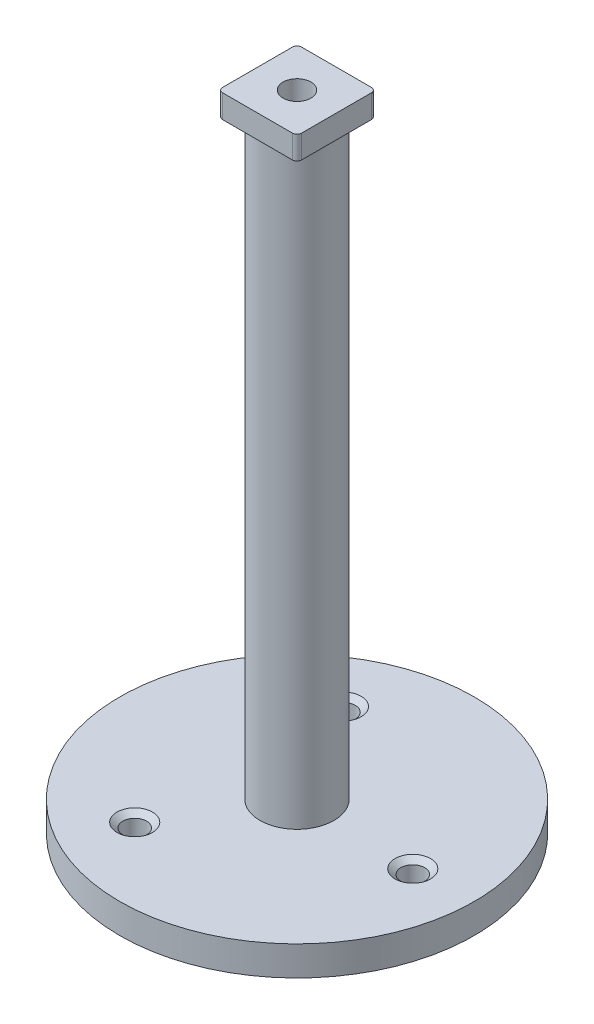
ISO-10303-21;
HEADER;
FILE_DESCRIPTION(('STEP AP214'),'2;1');
FILE_NAME('part.step','',(''),(''),'','','');
FILE_SCHEMA(('AUTOMOTIVE_DESIGN { 1 0 10303 214 1 1 1 1 }'));
ENDSEC;
DATA;
#1=APPLICATION_CONTEXT('core data for automotive mechanical design processes');
#2=APPLICATION_PROTOCOL_DEFINITION('international standard','automotive_design',2000,#1);
#3=PRODUCT_CONTEXT('',#1,'mechanical');
#4=PRODUCT('Part','Part','',(#3));
#5=PRODUCT_RELATED_PRODUCT_CATEGORY('part','',(#4));
#6=PRODUCT_DEFINITION_FORMATION('','',#4);
#7=PRODUCT_DEFINITION_CONTEXT('part definition',#1,'design');
#8=PRODUCT_DEFINITION('design','',#6,#7);
#9=PRODUCT_DEFINITION_SHAPE('','',#8);
#10=(LENGTH_UNIT() NAMED_UNIT(*) SI_UNIT(.MILLI.,.METRE.));
#11=(NAMED_UNIT(*) PLANE_ANGLE_UNIT() SI_UNIT($,.RADIAN.));
#12=(NAMED_UNIT(*) SI_UNIT($,.STERADIAN.) SOLID_ANGLE_UNIT());
#13=UNCERTAINTY_MEASURE_WITH_UNIT(LENGTH_MEASURE(1.E-05),#10,'distance_accuracy_value','');
#14=(GEOMETRIC_REPRESENTATION_CONTEXT(3) GLOBAL_UNCERTAINTY_ASSIGNED_CONTEXT((#13)) GLOBAL_UNIT_ASSIGNED_CONTEXT((#10,
#11,#12)) REPRESENTATION_CONTEXT('',''));
#15=CARTESIAN_POINT('',(0.,0.,0.));
#16=DIRECTION('',(0.,0.,1.));
#17=DIRECTION('',(1.,0.,0.));
#18=AXIS2_PLACEMENT_3D('',#15,#16,#17);
#19=CARTESIAN_POINT('',(0.,131.176985840386,0.));
#20=DIRECTION('',(0.,1.,0.));
#21=DIRECTION('',(0.,0.,1.));
#22=AXIS2_PLACEMENT_3D('',#19,#20,#21);
#23=CYLINDRICAL_SURFACE('',#22,7.93750000000001);
#24=CARTESIAN_POINT('',(0.,133.1,0.));
#25=DIRECTION('',(0.,1.,0.));
#26=DIRECTION('',(0.,0.,1.));
#27=AXIS2_PLACEMENT_3D('',#24,#25,#26);
#28=CIRCLE('',#27,7.93750000000001);
#29=CARTESIAN_POINT('',(0.,133.1,7.93750000000001));
#30=VERTEX_POINT('',#29);
#31=EDGE_CURVE('E12',#30,#30,#28,.F.);
#32=ORIENTED_EDGE('',*,*,#31,.T.);
#33=EDGE_LOOP('',(#32));
#34=FACE_BOUND('',#33,.T.);
#35=CARTESIAN_POINT('',(0.,6.34999999999999,0.));
#36=DIRECTION('',(0.,1.,0.));
#37=DIRECTION('',(0.,0.,1.));
#38=AXIS2_PLACEMENT_3D('',#35,#36,#37);
#39=CIRCLE('',#38,7.93750000000001);
#40=CARTESIAN_POINT('',(0.,6.34999999999999,7.93750000000001));
#41=VERTEX_POINT('',#40);
#42=EDGE_CURVE('E178',#41,#41,#39,.T.);
#43=ORIENTED_EDGE('',*,*,#42,.T.);
#44=EDGE_LOOP('',(#43));
#45=FACE_BOUND('',#44,.T.);
#46=ADVANCED_FACE('F44',(#34,#45),#23,.T.);
#47=CARTESIAN_POINT('',(38.1,6.35,0.));
#48=DIRECTION('',(0.,-1.,0.));
#49=DIRECTION('',(0.,0.,-1.));
#50=AXIS2_PLACEMENT_3D('',#47,#48,#49);
#51=PLANE('',#50);
#52=CARTESIAN_POINT('',(-12.2551624951336,6.35,-22.2479435503121));
#53=DIRECTION('',(0.,1.,0.));
#54=DIRECTION('',(0.,0.,1.));
#55=AXIS2_PLACEMENT_3D('',#52,#53,#54);
#56=CIRCLE('',#55,3.81);
#57=CARTESIAN_POINT('',(-12.2551624951336,6.35,-18.4379435503121));
#58=VERTEX_POINT('',#57);
#59=EDGE_CURVE('E313',#58,#58,#56,.T.);
#60=ORIENTED_EDGE('',*,*,#59,.F.);
#61=EDGE_LOOP('',(#60));
#62=FACE_BOUND('',#61,.T.);
#63=CARTESIAN_POINT('',(25.3948655440997,6.35,0.510689726862291));
#64=DIRECTION('',(0.,1.,0.));
#65=DIRECTION('',(0.,0.,1.));
#66=AXIS2_PLACEMENT_3D('',#63,#64,#65);
#67=CIRCLE('',#66,3.81);
#68=CARTESIAN_POINT('',(25.3948655440997,6.35,4.32068972686229));
#69=VERTEX_POINT('',#68);
#70=EDGE_CURVE('E301',#69,#69,#67,.T.);
#71=ORIENTED_EDGE('',*,*,#70,.F.);
#72=EDGE_LOOP('',(#71));
#73=FACE_BOUND('',#72,.T.);
#74=CARTESIAN_POINT('',(-13.1397030489638,6.35,21.7372538234475));
#75=DIRECTION('',(0.,1.,0.));
#76=DIRECTION('',(0.,0.,1.));
#77=AXIS2_PLACEMENT_3D('',#74,#75,#76);
#78=CIRCLE('',#77,3.81);
#79=CARTESIAN_POINT('',(-13.1397030489638,6.35,25.5472538234475));
#80=VERTEX_POINT('',#79);
#81=EDGE_CURVE('E289',#80,#80,#78,.T.);
#82=ORIENTED_EDGE('',*,*,#81,.F.);
#83=EDGE_LOOP('',(#82));
#84=FACE_BOUND('',#83,.T.);
#85=ORIENTED_EDGE('',*,*,#42,.F.);
#86=EDGE_LOOP('',(#85));
#87=FACE_BOUND('',#86,.T.);
#88=CARTESIAN_POINT('',(0.,6.34999999999999,0.));
#89=DIRECTION('',(0.,1.,0.));
#90=DIRECTION('',(0.,0.,1.));
#91=AXIS2_PLACEMENT_3D('',#88,#89,#90);
#92=CIRCLE('',#91,38.1);
#93=CARTESIAN_POINT('',(0.,6.34999999999999,38.1));
#94=VERTEX_POINT('',#93);
#95=EDGE_CURVE('E174',#94,#94,#92,.T.);
#96=ORIENTED_EDGE('',*,*,#95,.T.);
#97=EDGE_LOOP('',(#96));
#98=FACE_BOUND('',#97,.T.);
#99=ADVANCED_FACE('F238',(#62,#73,#84,#87,#98),#51,.F.);
#100=CARTESIAN_POINT('',(0.,131.176985840386,0.));
#101=DIRECTION('',(0.,1.,0.));
#102=DIRECTION('',(0.,0.,1.));
#103=AXIS2_PLACEMENT_3D('',#100,#101,#102);
#104=CYLINDRICAL_SURFACE('',#103,38.1);
#105=ORIENTED_EDGE('',*,*,#95,.F.);
#106=EDGE_LOOP('',(#105));
#107=FACE_BOUND('',#106,.T.);
#108=CARTESIAN_POINT('',(0.,0.,0.));
#109=DIRECTION('',(0.,1.,0.));
#110=DIRECTION('',(0.,0.,1.));
#111=AXIS2_PLACEMENT_3D('',#108,#109,#110);
#112=CIRCLE('',#111,38.1);
#113=CARTESIAN_POINT('',(0.,0.,38.1));
#114=VERTEX_POINT('',#113);
#115=EDGE_CURVE('E170',#114,#114,#112,.T.);
#116=ORIENTED_EDGE('',*,*,#115,.T.);
#117=EDGE_LOOP('',(#116));
#118=FACE_BOUND('',#117,.T.);
#119=ADVANCED_FACE('F245',(#107,#118),#104,.T.);
#120=CARTESIAN_POINT('',(0.,0.,0.));
#121=DIRECTION('',(0.,1.,0.));
#122=DIRECTION('',(0.,0.,1.));
#123=AXIS2_PLACEMENT_3D('',#120,#121,#122);
#124=PLANE('',#123);
#125=CARTESIAN_POINT('',(-12.2551624951336,0.,-22.2479435503121));
#126=DIRECTION('',(0.,1.,0.));
#127=DIRECTION('',(0.,0.,1.));
#128=AXIS2_PLACEMENT_3D('',#125,#126,#127);
#129=CIRCLE('',#128,2.5527);
#130=CARTESIAN_POINT('',(-12.2551624951336,0.,-19.6952435503121));
#131=VERTEX_POINT('',#130);
#132=EDGE_CURVE('E305',#131,#131,#129,.T.);
#133=ORIENTED_EDGE('',*,*,#132,.T.);
#134=EDGE_LOOP('',(#133));
#135=FACE_BOUND('',#134,.T.);
#136=CARTESIAN_POINT('',(25.3948655440997,0.,0.510689726862291));
#137=DIRECTION('',(0.,1.,0.));
#138=DIRECTION('',(0.,0.,1.));
#139=AXIS2_PLACEMENT_3D('',#136,#137,#138);
#140=CIRCLE('',#139,2.5527);
#141=CARTESIAN_POINT('',(25.3948655440997,0.,3.06338972686229));
#142=VERTEX_POINT('',#141);
#143=EDGE_CURVE('E293',#142,#142,#140,.T.);
#144=ORIENTED_EDGE('',*,*,#143,.T.);
#145=EDGE_LOOP('',(#144));
#146=FACE_BOUND('',#145,.T.);
#147=CARTESIAN_POINT('',(-13.1397030489638,0.,21.7372538234475));
#148=DIRECTION('',(0.,1.,0.));
#149=DIRECTION('',(0.,0.,1.));
#150=AXIS2_PLACEMENT_3D('',#147,#148,#149);
#151=CIRCLE('',#150,2.5527);
#152=CARTESIAN_POINT('',(-13.1397030489638,0.,24.2899538234475));
#153=VERTEX_POINT('',#152);
#154=EDGE_CURVE('E281',#153,#153,#151,.T.);
#155=ORIENTED_EDGE('',*,*,#154,.T.);
#156=EDGE_LOOP('',(#155));
#157=FACE_BOUND('',#156,.T.);
#158=CARTESIAN_POINT('',(0.,0.,0.));
#159=DIRECTION('',(0.,1.,0.));
#160=DIRECTION('',(0.,0.,1.));
#161=AXIS2_PLACEMENT_3D('',#158,#159,#160);
#162=CIRCLE('',#161,7.14375);
#163=CARTESIAN_POINT('',(0.,0.,7.14375));
#164=VERTEX_POINT('',#163);
#165=EDGE_CURVE('E162',#164,#164,#162,.T.);
#166=ORIENTED_EDGE('',*,*,#165,.T.);
#167=EDGE_LOOP('',(#166));
#168=FACE_BOUND('',#167,.T.);
#169=ORIENTED_EDGE('',*,*,#115,.F.);
#170=EDGE_LOOP('',(#169));
#171=FACE_BOUND('',#170,.T.);
#172=ADVANCED_FACE('F330',(#135,#146,#157,#168,#171),#124,.F.);
#173=CARTESIAN_POINT('',(0.,153.555576272406,0.));
#174=DIRECTION('',(0.,-1.,0.));
#175=DIRECTION('',(0.,0.,-1.));
#176=AXIS2_PLACEMENT_3D('',#173,#174,#175);
#177=CYLINDRICAL_SURFACE('',#176,7.14375);
#178=CARTESIAN_POINT('',(0.,120.65,0.));
#179=DIRECTION('',(0.,-1.,0.));
#180=DIRECTION('',(0.,0.,-1.));
#181=AXIS2_PLACEMENT_3D('',#178,#179,#180);
#182=CIRCLE('',#181,7.14375);
#183=CARTESIAN_POINT('',(0.,120.65,-7.14375));
#184=VERTEX_POINT('',#183);
#185=EDGE_CURVE('E166',#184,#184,#182,.T.);
#186=ORIENTED_EDGE('',*,*,#185,.F.);
#187=EDGE_LOOP('',(#186));
#188=FACE_BOUND('',#187,.T.);
#189=ORIENTED_EDGE('',*,*,#165,.F.);
#190=EDGE_LOOP('',(#189));
#191=FACE_BOUND('',#190,.T.);
#192=ADVANCED_FACE('F334',(#188,#191),#177,.F.);
#193=CARTESIAN_POINT('',(0.,120.65,0.));
#194=DIRECTION('',(0.,-1.,0.));
#195=DIRECTION('',(0.,0.,-1.));
#196=AXIS2_PLACEMENT_3D('',#193,#194,#195);
#197=PLANE('',#196);
#198=CARTESIAN_POINT('',(0.,120.65,0.));
#199=DIRECTION('',(0.,-1.,0.));
#200=DIRECTION('',(0.,0.,-1.));
#201=AXIS2_PLACEMENT_3D('',#198,#199,#200);
#202=CIRCLE('',#201,3.);
#203=CARTESIAN_POINT('',(0.,120.65,-3.));
#204=VERTEX_POINT('',#203);
#205=EDGE_CURVE('E143',#204,#204,#202,.T.);
#206=ORIENTED_EDGE('',*,*,#205,.F.);
#207=EDGE_LOOP('',(#206));
#208=FACE_BOUND('',#207,.T.);
#209=ORIENTED_EDGE('',*,*,#185,.T.);
#210=EDGE_LOOP('',(#209));
#211=FACE_BOUND('',#210,.T.);
#212=ADVANCED_FACE('F341',(#208,#211),#197,.T.);
#213=CARTESIAN_POINT('',(8.5,138.35,-8.5));
#214=DIRECTION('',(-1.,0.,0.));
#215=DIRECTION('',(0.,0.,1.));
#216=AXIS2_PLACEMENT_3D('',#213,#214,#215);
#217=PLANE('',#216);
#218=DIRECTION('',(0.,0.,-1.));
#219=VECTOR('',#218,1.);
#220=CARTESIAN_POINT('',(8.5,138.35,-8.5));
#221=LINE('',#220,#219);
#222=CARTESIAN_POINT('',(8.5,138.35,7.5));
#223=VERTEX_POINT('',#222);
#224=CARTESIAN_POINT('',(8.5,138.35,-7.5));
#225=VERTEX_POINT('',#224);
#226=EDGE_CURVE('E133',#223,#225,#221,.T.);
#227=ORIENTED_EDGE('',*,*,#226,.F.);
#228=DIRECTION('',(0.,-1.,0.));
#229=VECTOR('',#228,1.);
#230=CARTESIAN_POINT('',(8.5,138.35,7.5));
#231=LINE('',#230,#229);
#232=CARTESIAN_POINT('',(8.5,133.35,7.5));
#233=VERTEX_POINT('',#232);
#234=EDGE_CURVE('E116',#223,#233,#231,.T.);
#235=ORIENTED_EDGE('',*,*,#234,.T.);
#236=DIRECTION('',(0.,0.,-1.));
#237=VECTOR('',#236,1.);
#238=CARTESIAN_POINT('',(8.5,133.35,-8.5));
#239=LINE('',#238,#237);
#240=CARTESIAN_POINT('',(8.5,133.35,-7.5));
#241=VERTEX_POINT('',#240);
#242=EDGE_CURVE('E130',#233,#241,#239,.T.);
#243=ORIENTED_EDGE('',*,*,#242,.T.);
#244=DIRECTION('',(0.,-1.,0.));
#245=VECTOR('',#244,1.);
#246=CARTESIAN_POINT('',(8.5,138.35,-7.5));
#247=LINE('',#246,#245);
#248=EDGE_CURVE('E136',#241,#225,#247,.F.);
#249=ORIENTED_EDGE('',*,*,#248,.T.);
#250=EDGE_LOOP('',(#227,#235,#243,#249));
#251=FACE_BOUND('',#250,.T.);
#252=ADVANCED_FACE('F129',(#251),#217,.F.);
#253=CARTESIAN_POINT('',(-8.5,138.35,-8.5));
#254=DIRECTION('',(0.,0.,1.));
#255=DIRECTION('',(1.,0.,0.));
#256=AXIS2_PLACEMENT_3D('',#253,#254,#255);
#257=PLANE('',#256);
#258=DIRECTION('',(-1.,0.,0.));
#259=VECTOR('',#258,1.);
#260=CARTESIAN_POINT('',(-8.5,138.35,-8.5));
#261=LINE('',#260,#259);
#262=CARTESIAN_POINT('',(7.5,138.35,-8.5));
#263=VERTEX_POINT('',#262);
#264=CARTESIAN_POINT('',(-7.5,138.35,-8.5));
#265=VERTEX_POINT('',#264);
#266=EDGE_CURVE('E267',#263,#265,#261,.T.);
#267=ORIENTED_EDGE('',*,*,#266,.F.);
#268=DIRECTION('',(0.,-1.,0.));
#269=VECTOR('',#268,1.);
#270=CARTESIAN_POINT('',(7.5,138.35,-8.5));
#271=LINE('',#270,#269);
#272=CARTESIAN_POINT('',(7.5,133.35,-8.5));
#273=VERTEX_POINT('',#272);
#274=EDGE_CURVE('E215',#263,#273,#271,.T.);
#275=ORIENTED_EDGE('',*,*,#274,.T.);
#276=DIRECTION('',(-1.,0.,0.));
#277=VECTOR('',#276,1.);
#278=CARTESIAN_POINT('',(-8.5,133.35,-8.5));
#279=LINE('',#278,#277);
#280=CARTESIAN_POINT('',(-7.5,133.35,-8.5));
#281=VERTEX_POINT('',#280);
#282=EDGE_CURVE('E142',#273,#281,#279,.T.);
#283=ORIENTED_EDGE('',*,*,#282,.T.);
#284=DIRECTION('',(0.,-1.,0.));
#285=VECTOR('',#284,1.);
#286=CARTESIAN_POINT('',(-7.5,138.35,-8.5));
#287=LINE('',#286,#285);
#288=EDGE_CURVE('E212',#281,#265,#287,.F.);
#289=ORIENTED_EDGE('',*,*,#288,.T.);
#290=EDGE_LOOP('',(#267,#275,#283,#289));
#291=FACE_BOUND('',#290,.T.);
#292=ADVANCED_FACE('F269',(#291),#257,.F.);
#293=CARTESIAN_POINT('',(-8.5,138.35,-8.5));
#294=DIRECTION('',(1.,0.,0.));
#295=DIRECTION('',(0.,0.,-1.));
#296=AXIS2_PLACEMENT_3D('',#293,#294,#295);
#297=PLANE('',#296);
#298=DIRECTION('',(0.,0.,1.));
#299=VECTOR('',#298,1.);
#300=CARTESIAN_POINT('',(-8.5,133.35,-8.5));
#301=LINE('',#300,#299);
#302=CARTESIAN_POINT('',(-8.5,133.35,-7.5));
#303=VERTEX_POINT('',#302);
#304=CARTESIAN_POINT('',(-8.5,133.35,7.5));
#305=VERTEX_POINT('',#304);
#306=EDGE_CURVE('E148',#303,#305,#301,.T.);
#307=ORIENTED_EDGE('',*,*,#306,.T.);
#308=DIRECTION('',(0.,-1.,0.));
#309=VECTOR('',#308,1.);
#310=CARTESIAN_POINT('',(-8.5,138.35,7.5));
#311=LINE('',#310,#309);
#312=CARTESIAN_POINT('',(-8.5,138.35,7.5));
#313=VERTEX_POINT('',#312);
#314=EDGE_CURVE('E60',#305,#313,#311,.F.);
#315=ORIENTED_EDGE('',*,*,#314,.T.);
#316=DIRECTION('',(0.,0.,1.));
#317=VECTOR('',#316,1.);
#318=CARTESIAN_POINT('',(-8.5,138.35,-8.5));
#319=LINE('',#318,#317);
#320=CARTESIAN_POINT('',(-8.5,138.35,-7.5));
#321=VERTEX_POINT('',#320);
#322=EDGE_CURVE('E272',#321,#313,#319,.T.);
#323=ORIENTED_EDGE('',*,*,#322,.F.);
#324=DIRECTION('',(0.,-1.,0.));
#325=VECTOR('',#324,1.);
#326=CARTESIAN_POINT('',(-8.5,138.35,-7.5));
#327=LINE('',#326,#325);
#328=EDGE_CURVE('E206',#321,#303,#327,.T.);
#329=ORIENTED_EDGE('',*,*,#328,.T.);
#330=EDGE_LOOP('',(#307,#315,#323,#329));
#331=FACE_BOUND('',#330,.T.);
#332=ADVANCED_FACE('F353',(#331),#297,.F.);
#333=CARTESIAN_POINT('',(-8.5,138.35,8.5));
#334=DIRECTION('',(0.,0.,-1.));
#335=DIRECTION('',(-1.,0.,0.));
#336=AXIS2_PLACEMENT_3D('',#333,#334,#335);
#337=PLANE('',#336);
#338=DIRECTION('',(1.,0.,0.));
#339=VECTOR('',#338,1.);
#340=CARTESIAN_POINT('',(-8.5,133.35,8.5));
#341=LINE('',#340,#339);
#342=CARTESIAN_POINT('',(-7.5,133.35,8.5));
#343=VERTEX_POINT('',#342);
#344=CARTESIAN_POINT('',(7.5,133.35,8.5));
#345=VERTEX_POINT('',#344);
#346=EDGE_CURVE('E159',#343,#345,#341,.T.);
#347=ORIENTED_EDGE('',*,*,#346,.T.);
#348=DIRECTION('',(0.,-1.,0.));
#349=VECTOR('',#348,1.);
#350=CARTESIAN_POINT('',(7.5,138.35,8.5));
#351=LINE('',#350,#349);
#352=CARTESIAN_POINT('',(7.5,138.35,8.5));
#353=VERTEX_POINT('',#352);
#354=EDGE_CURVE('E117',#345,#353,#351,.F.);
#355=ORIENTED_EDGE('',*,*,#354,.T.);
#356=DIRECTION('',(1.,0.,0.));
#357=VECTOR('',#356,1.);
#358=CARTESIAN_POINT('',(-8.5,138.35,8.5));
#359=LINE('',#358,#357);
#360=CARTESIAN_POINT('',(-7.5,138.35,8.5));
#361=VERTEX_POINT('',#360);
#362=EDGE_CURVE('E154',#361,#353,#359,.T.);
#363=ORIENTED_EDGE('',*,*,#362,.F.);
#364=DIRECTION('',(0.,-1.,0.));
#365=VECTOR('',#364,1.);
#366=CARTESIAN_POINT('',(-7.5,138.35,8.5));
#367=LINE('',#366,#365);
#368=EDGE_CURVE('E123',#361,#343,#367,.T.);
#369=ORIENTED_EDGE('',*,*,#368,.T.);
#370=EDGE_LOOP('',(#347,#355,#363,#369));
#371=FACE_BOUND('',#370,.T.);
#372=ADVANCED_FACE('F356',(#371),#337,.F.);
#373=CARTESIAN_POINT('',(0.,138.35,0.));
#374=DIRECTION('',(0.,1.,0.));
#375=DIRECTION('',(0.,0.,1.));
#376=AXIS2_PLACEMENT_3D('',#373,#374,#375);
#377=PLANE('',#376);
#378=CARTESIAN_POINT('',(0.,138.35,0.));
#379=DIRECTION('',(0.,1.,0.));
#380=DIRECTION('',(0.,0.,1.));
#381=AXIS2_PLACEMENT_3D('',#378,#379,#380);
#382=CIRCLE('',#381,3.);
#383=CARTESIAN_POINT('',(0.,138.35,3.));
#384=VERTEX_POINT('',#383);
#385=EDGE_CURVE('E151',#384,#384,#382,.T.);
#386=ORIENTED_EDGE('',*,*,#385,.F.);
#387=EDGE_LOOP('',(#386));
#388=FACE_BOUND('',#387,.T.);
#389=ORIENTED_EDGE('',*,*,#362,.T.);
#390=CARTESIAN_POINT('',(7.5,138.35,7.5));
#391=DIRECTION('',(0.,1.,0.));
#392=DIRECTION('',(0.,0.,1.));
#393=AXIS2_PLACEMENT_3D('',#390,#391,#392);
#394=CIRCLE('',#393,1.);
#395=EDGE_CURVE('E203',#353,#223,#394,.T.);
#396=ORIENTED_EDGE('',*,*,#395,.T.);
#397=ORIENTED_EDGE('',*,*,#226,.T.);
#398=CARTESIAN_POINT('',(7.5,138.35,-7.5));
#399=DIRECTION('',(0.,1.,0.));
#400=DIRECTION('',(0.,0.,1.));
#401=AXIS2_PLACEMENT_3D('',#398,#399,#400);
#402=CIRCLE('',#401,1.);
#403=EDGE_CURVE('E197',#225,#263,#402,.T.);
#404=ORIENTED_EDGE('',*,*,#403,.T.);
#405=ORIENTED_EDGE('',*,*,#266,.T.);
#406=CARTESIAN_POINT('',(-7.5,138.35,-7.5));
#407=DIRECTION('',(0.,1.,0.));
#408=DIRECTION('',(0.,0.,1.));
#409=AXIS2_PLACEMENT_3D('',#406,#407,#408);
#410=CIRCLE('',#409,1.);
#411=EDGE_CURVE('E67',#265,#321,#410,.T.);
#412=ORIENTED_EDGE('',*,*,#411,.T.);
#413=ORIENTED_EDGE('',*,*,#322,.T.);
#414=CARTESIAN_POINT('',(-7.5,138.35,7.5));
#415=DIRECTION('',(0.,1.,0.));
#416=DIRECTION('',(0.,0.,1.));
#417=AXIS2_PLACEMENT_3D('',#414,#415,#416);
#418=CIRCLE('',#417,1.);
#419=EDGE_CURVE('E200',#313,#361,#418,.T.);
#420=ORIENTED_EDGE('',*,*,#419,.T.);
#421=EDGE_LOOP('',(#389,#396,#397,#404,#405,#412,#413,#420));
#422=FACE_BOUND('',#421,.T.);
#423=ADVANCED_FACE('F266',(#388,#422),#377,.T.);
#424=CARTESIAN_POINT('',(0.,133.35,0.));
#425=DIRECTION('',(0.,1.,0.));
#426=DIRECTION('',(0.,0.,1.));
#427=AXIS2_PLACEMENT_3D('',#424,#425,#426);
#428=PLANE('',#427);
#429=CARTESIAN_POINT('',(0.,133.35,0.));
#430=DIRECTION('',(0.,1.,0.));
#431=DIRECTION('',(0.,0.,1.));
#432=AXIS2_PLACEMENT_3D('',#429,#430,#431);
#433=CIRCLE('',#432,8.18750000000001);
#434=CARTESIAN_POINT('',(0.,133.35,8.18750000000001));
#435=VERTEX_POINT('',#434);
#436=EDGE_CURVE('E53',#435,#435,#433,.T.);
#437=ORIENTED_EDGE('',*,*,#436,.T.);
#438=EDGE_LOOP('',(#437));
#439=FACE_BOUND('',#438,.T.);
#440=ORIENTED_EDGE('',*,*,#242,.F.);
#441=CARTESIAN_POINT('',(7.5,133.35,7.5));
#442=DIRECTION('',(0.,1.,0.));
#443=DIRECTION('',(0.,0.,1.));
#444=AXIS2_PLACEMENT_3D('',#441,#442,#443);
#445=CIRCLE('',#444,1.);
#446=EDGE_CURVE('E112',#233,#345,#445,.F.);
#447=ORIENTED_EDGE('',*,*,#446,.T.);
#448=ORIENTED_EDGE('',*,*,#346,.F.);
#449=CARTESIAN_POINT('',(-7.5,133.35,7.5));
#450=DIRECTION('',(0.,1.,0.));
#451=DIRECTION('',(0.,0.,1.));
#452=AXIS2_PLACEMENT_3D('',#449,#450,#451);
#453=CIRCLE('',#452,1.);
#454=EDGE_CURVE('E124',#343,#305,#453,.F.);
#455=ORIENTED_EDGE('',*,*,#454,.T.);
#456=ORIENTED_EDGE('',*,*,#306,.F.);
#457=CARTESIAN_POINT('',(-7.5,133.35,-7.5));
#458=DIRECTION('',(0.,1.,0.));
#459=DIRECTION('',(0.,0.,1.));
#460=AXIS2_PLACEMENT_3D('',#457,#458,#459);
#461=CIRCLE('',#460,1.);
#462=EDGE_CURVE('E135',#303,#281,#461,.F.);
#463=ORIENTED_EDGE('',*,*,#462,.T.);
#464=ORIENTED_EDGE('',*,*,#282,.F.);
#465=CARTESIAN_POINT('',(7.5,133.35,-7.5));
#466=DIRECTION('',(0.,1.,0.));
#467=DIRECTION('',(0.,0.,1.));
#468=AXIS2_PLACEMENT_3D('',#465,#466,#467);
#469=CIRCLE('',#468,1.);
#470=EDGE_CURVE('E140',#273,#241,#469,.F.);
#471=ORIENTED_EDGE('',*,*,#470,.T.);
#472=EDGE_LOOP('',(#440,#447,#448,#455,#456,#463,#464,#471));
#473=FACE_BOUND('',#472,.T.);
#474=ADVANCED_FACE('F138',(#439,#473),#428,.F.);
#475=CARTESIAN_POINT('',(0.,0.,0.));
#476=DIRECTION('',(0.,1.,0.));
#477=DIRECTION('',(0.,0.,1.));
#478=AXIS2_PLACEMENT_3D('',#475,#476,#477);
#479=CYLINDRICAL_SURFACE('',#478,3.);
#480=ORIENTED_EDGE('',*,*,#205,.T.);
#481=EDGE_LOOP('',(#480));
#482=FACE_BOUND('',#481,.T.);
#483=ORIENTED_EDGE('',*,*,#385,.T.);
#484=EDGE_LOOP('',(#483));
#485=FACE_BOUND('',#484,.T.);
#486=ADVANCED_FACE('F254',(#482,#485),#479,.F.);
#487=CARTESIAN_POINT('',(7.5,138.35,7.5));
#488=DIRECTION('',(0.,-1.,0.));
#489=DIRECTION('',(0.,0.,-1.));
#490=AXIS2_PLACEMENT_3D('',#487,#488,#489);
#491=CYLINDRICAL_SURFACE('',#490,1.);
#492=ORIENTED_EDGE('',*,*,#395,.F.);
#493=ORIENTED_EDGE('',*,*,#354,.F.);
#494=ORIENTED_EDGE('',*,*,#446,.F.);
#495=ORIENTED_EDGE('',*,*,#234,.F.);
#496=EDGE_LOOP('',(#492,#493,#494,#495));
#497=FACE_BOUND('',#496,.T.);
#498=ADVANCED_FACE('F115',(#497),#491,.T.);
#499=CARTESIAN_POINT('',(-7.5,138.35,7.5));
#500=DIRECTION('',(0.,-1.,0.));
#501=DIRECTION('',(0.,0.,-1.));
#502=AXIS2_PLACEMENT_3D('',#499,#500,#501);
#503=CYLINDRICAL_SURFACE('',#502,1.);
#504=ORIENTED_EDGE('',*,*,#419,.F.);
#505=ORIENTED_EDGE('',*,*,#314,.F.);
#506=ORIENTED_EDGE('',*,*,#454,.F.);
#507=ORIENTED_EDGE('',*,*,#368,.F.);
#508=EDGE_LOOP('',(#504,#505,#506,#507));
#509=FACE_BOUND('',#508,.T.);
#510=ADVANCED_FACE('F253',(#509),#503,.T.);
#511=CARTESIAN_POINT('',(7.5,138.35,-7.5));
#512=DIRECTION('',(0.,-1.,0.));
#513=DIRECTION('',(0.,0.,-1.));
#514=AXIS2_PLACEMENT_3D('',#511,#512,#513);
#515=CYLINDRICAL_SURFACE('',#514,1.);
#516=ORIENTED_EDGE('',*,*,#403,.F.);
#517=ORIENTED_EDGE('',*,*,#248,.F.);
#518=ORIENTED_EDGE('',*,*,#470,.F.);
#519=ORIENTED_EDGE('',*,*,#274,.F.);
#520=EDGE_LOOP('',(#516,#517,#518,#519));
#521=FACE_BOUND('',#520,.T.);
#522=ADVANCED_FACE('F234',(#521),#515,.T.);
#523=CARTESIAN_POINT('',(-7.5,138.35,-7.5));
#524=DIRECTION('',(0.,-1.,0.));
#525=DIRECTION('',(0.,0.,-1.));
#526=AXIS2_PLACEMENT_3D('',#523,#524,#525);
#527=CYLINDRICAL_SURFACE('',#526,1.);
#528=ORIENTED_EDGE('',*,*,#411,.F.);
#529=ORIENTED_EDGE('',*,*,#288,.F.);
#530=ORIENTED_EDGE('',*,*,#462,.F.);
#531=ORIENTED_EDGE('',*,*,#328,.F.);
#532=EDGE_LOOP('',(#528,#529,#530,#531));
#533=FACE_BOUND('',#532,.T.);
#534=ADVANCED_FACE('F225',(#533),#527,.T.);
#535=CARTESIAN_POINT('',(0.,133.1,0.));
#536=DIRECTION('',(0.,1.,0.));
#537=DIRECTION('',(0.,0.,1.));
#538=AXIS2_PLACEMENT_3D('',#535,#536,#537);
#539=TOROIDAL_SURFACE('',#538,8.18750000000001,0.25);
#540=ORIENTED_EDGE('',*,*,#31,.F.);
#541=EDGE_LOOP('',(#540));
#542=FACE_BOUND('',#541,.T.);
#543=ORIENTED_EDGE('',*,*,#436,.F.);
#544=EDGE_LOOP('',(#543));
#545=FACE_BOUND('',#544,.T.);
#546=ADVANCED_FACE('F46',(#542,#545),#539,.F.);
#547=CARTESIAN_POINT('',(-13.1397030489638,6.35,21.7372538234475));
#548=DIRECTION('',(0.,1.,0.));
#549=DIRECTION('',(0.,0.,1.));
#550=AXIS2_PLACEMENT_3D('',#547,#548,#549);
#551=CYLINDRICAL_SURFACE('',#550,2.5527);
#552=ORIENTED_EDGE('',*,*,#154,.F.);
#553=EDGE_LOOP('',(#552));
#554=FACE_BOUND('',#553,.T.);
#555=CARTESIAN_POINT('',(-13.1397030489638,5.2950000337208,21.7372538234475));
#556=DIRECTION('',(0.,1.,0.));
#557=DIRECTION('',(0.,0.,1.));
#558=AXIS2_PLACEMENT_3D('',#555,#556,#557);
#559=CIRCLE('',#558,2.5527);
#560=CARTESIAN_POINT('',(-13.1397030489638,5.2950000337208,24.2899538234475));
#561=VERTEX_POINT('',#560);
#562=EDGE_CURVE('E285',#561,#561,#559,.T.);
#563=ORIENTED_EDGE('',*,*,#562,.T.);
#564=EDGE_LOOP('',(#563));
#565=FACE_BOUND('',#564,.T.);
#566=ADVANCED_FACE('F224',(#554,#565),#551,.F.);
#567=CARTESIAN_POINT('',(-13.1397030489638,6.35,21.7372538234475));
#568=DIRECTION('',(0.,1.,0.));
#569=DIRECTION('',(0.,0.,1.));
#570=AXIS2_PLACEMENT_3D('',#567,#568,#569);
#571=CONICAL_SURFACE('',#570,3.81,0.872664625997163);
#572=ORIENTED_EDGE('',*,*,#562,.F.);
#573=EDGE_LOOP('',(#572));
#574=FACE_BOUND('',#573,.T.);
#575=ORIENTED_EDGE('',*,*,#81,.T.);
#576=EDGE_LOOP('',(#575));
#577=FACE_BOUND('',#576,.T.);
#578=ADVANCED_FACE('F231',(#574,#577),#571,.F.);
#579=CARTESIAN_POINT('',(25.3948655440997,6.35,0.510689726862291));
#580=DIRECTION('',(0.,1.,0.));
#581=DIRECTION('',(0.,0.,1.));
#582=AXIS2_PLACEMENT_3D('',#579,#580,#581);
#583=CYLINDRICAL_SURFACE('',#582,2.5527);
#584=ORIENTED_EDGE('',*,*,#143,.F.);
#585=EDGE_LOOP('',(#584));
#586=FACE_BOUND('',#585,.T.);
#587=CARTESIAN_POINT('',(25.3948655440997,5.2950000337208,0.510689726862291));
#588=DIRECTION('',(0.,1.,0.));
#589=DIRECTION('',(0.,0.,1.));
#590=AXIS2_PLACEMENT_3D('',#587,#588,#589);
#591=CIRCLE('',#590,2.5527);
#592=CARTESIAN_POINT('',(25.3948655440997,5.2950000337208,3.06338972686229));
#593=VERTEX_POINT('',#592);
#594=EDGE_CURVE('E297',#593,#593,#591,.T.);
#595=ORIENTED_EDGE('',*,*,#594,.T.);
#596=EDGE_LOOP('',(#595));
#597=FACE_BOUND('',#596,.T.);
#598=ADVANCED_FACE('F370',(#586,#597),#583,.F.);
#599=CARTESIAN_POINT('',(25.3948655440997,6.35,0.510689726862291));
#600=DIRECTION('',(0.,1.,0.));
#601=DIRECTION('',(0.,0.,1.));
#602=AXIS2_PLACEMENT_3D('',#599,#600,#601);
#603=CONICAL_SURFACE('',#602,3.81,0.872664625997163);
#604=ORIENTED_EDGE('',*,*,#594,.F.);
#605=EDGE_LOOP('',(#604));
#606=FACE_BOUND('',#605,.T.);
#607=ORIENTED_EDGE('',*,*,#70,.T.);
#608=EDGE_LOOP('',(#607));
#609=FACE_BOUND('',#608,.T.);
#610=ADVANCED_FACE('F374',(#606,#609),#603,.F.);
#611=CARTESIAN_POINT('',(-12.2551624951336,6.35,-22.2479435503121));
#612=DIRECTION('',(0.,1.,0.));
#613=DIRECTION('',(0.,0.,1.));
#614=AXIS2_PLACEMENT_3D('',#611,#612,#613);
#615=CYLINDRICAL_SURFACE('',#614,2.5527);
#616=ORIENTED_EDGE('',*,*,#132,.F.);
#617=EDGE_LOOP('',(#616));
#618=FACE_BOUND('',#617,.T.);
#619=CARTESIAN_POINT('',(-12.2551624951336,5.2950000337208,-22.2479435503121));
#620=DIRECTION('',(0.,1.,0.));
#621=DIRECTION('',(0.,0.,1.));
#622=AXIS2_PLACEMENT_3D('',#619,#620,#621);
#623=CIRCLE('',#622,2.5527);
#624=CARTESIAN_POINT('',(-12.2551624951336,5.2950000337208,-19.6952435503121));
#625=VERTEX_POINT('',#624);
#626=EDGE_CURVE('E309',#625,#625,#623,.T.);
#627=ORIENTED_EDGE('',*,*,#626,.T.);
#628=EDGE_LOOP('',(#627));
#629=FACE_BOUND('',#628,.T.);
#630=ADVANCED_FACE('F378',(#618,#629),#615,.F.);
#631=CARTESIAN_POINT('',(-12.2551624951336,6.35,-22.2479435503121));
#632=DIRECTION('',(0.,1.,0.));
#633=DIRECTION('',(0.,0.,1.));
#634=AXIS2_PLACEMENT_3D('',#631,#632,#633);
#635=CONICAL_SURFACE('',#634,3.81,0.872664625997163);
#636=ORIENTED_EDGE('',*,*,#626,.F.);
#637=EDGE_LOOP('',(#636));
#638=FACE_BOUND('',#637,.T.);
#639=ORIENTED_EDGE('',*,*,#59,.T.);
#640=EDGE_LOOP('',(#639));
#641=FACE_BOUND('',#640,.T.);
#642=ADVANCED_FACE('F318',(#638,#641),#635,.F.);
#643=CLOSED_SHELL('',(#46,#99,#119,#172,#192,#212,#252,#292,#332,#372,#423,#474,#486,#498,#510,
#522,#534,#546,#566,#578,#598,#610,#630,#642));
#644=MANIFOLD_SOLID_BREP('B2',#643);
#645=ADVANCED_BREP_SHAPE_REPRESENTATION('',(#18,#644),#14);
#646=SHAPE_DEFINITION_REPRESENTATION(#9,#645);
ENDSEC;
END-ISO-10303-21;
